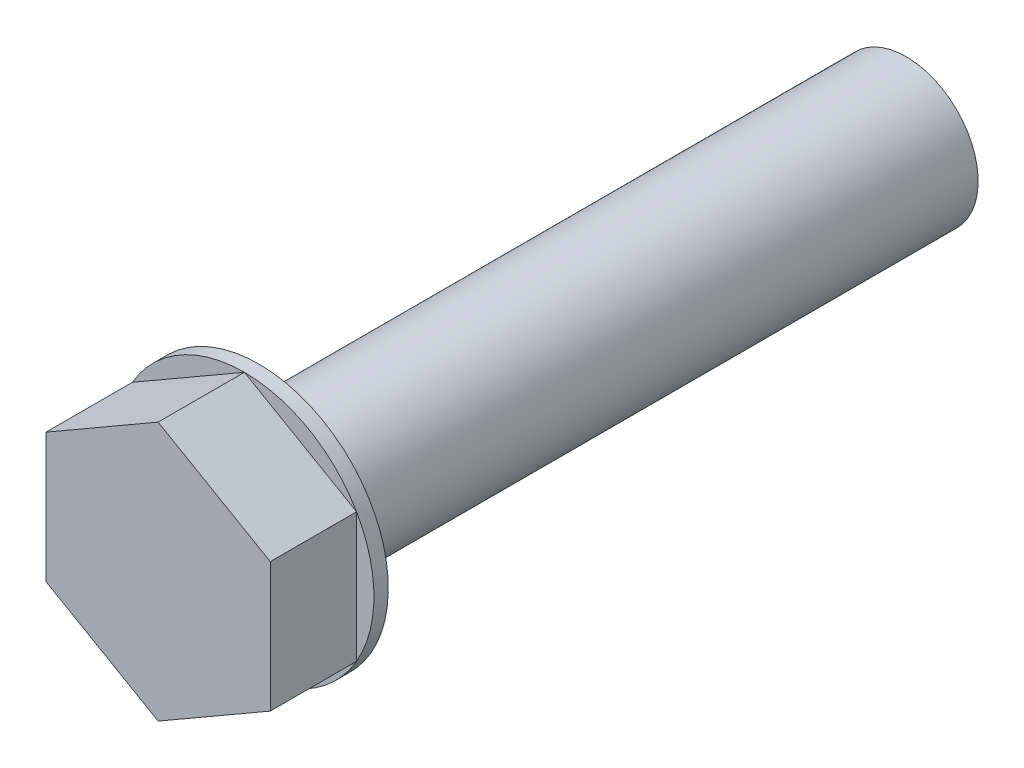
ISO-10303-21;
HEADER;
FILE_DESCRIPTION(('STEP AP214'),'2;1');
FILE_NAME('part.step','',(''),(''),'','','');
FILE_SCHEMA(('AUTOMOTIVE_DESIGN { 1 0 10303 214 1 1 1 1 }'));
ENDSEC;
DATA;
#1=APPLICATION_CONTEXT('core data for automotive mechanical design processes');
#2=APPLICATION_PROTOCOL_DEFINITION('international standard','automotive_design',2000,#1);
#3=PRODUCT_CONTEXT('',#1,'mechanical');
#4=PRODUCT('Part','Part','',(#3));
#5=PRODUCT_RELATED_PRODUCT_CATEGORY('part','',(#4));
#6=PRODUCT_DEFINITION_FORMATION('','',#4);
#7=PRODUCT_DEFINITION_CONTEXT('part definition',#1,'design');
#8=PRODUCT_DEFINITION('design','',#6,#7);
#9=PRODUCT_DEFINITION_SHAPE('','',#8);
#10=(LENGTH_UNIT() NAMED_UNIT(*) SI_UNIT(.MILLI.,.METRE.));
#11=(NAMED_UNIT(*) PLANE_ANGLE_UNIT() SI_UNIT($,.RADIAN.));
#12=(NAMED_UNIT(*) SI_UNIT($,.STERADIAN.) SOLID_ANGLE_UNIT());
#13=UNCERTAINTY_MEASURE_WITH_UNIT(LENGTH_MEASURE(1.E-05),#10,'distance_accuracy_value','');
#14=(GEOMETRIC_REPRESENTATION_CONTEXT(3) GLOBAL_UNCERTAINTY_ASSIGNED_CONTEXT((#13)) GLOBAL_UNIT_ASSIGNED_CONTEXT((#10,
#11,#12)) REPRESENTATION_CONTEXT('',''));
#15=CARTESIAN_POINT('',(0.,0.,0.));
#16=DIRECTION('',(0.,0.,1.));
#17=DIRECTION('',(1.,0.,0.));
#18=AXIS2_PLACEMENT_3D('',#15,#16,#17);
#19=CARTESIAN_POINT('',(7.7942286340599,4.50000000000009,6.));
#20=DIRECTION('',(-0.499999999999995,-0.866025403784441,0.));
#21=DIRECTION('',(0.866025403784442,-0.499999999999995,0.));
#22=AXIS2_PLACEMENT_3D('',#19,#20,#21);
#23=PLANE('',#22);
#24=DIRECTION('',(-0.866025403784442,0.499999999999995,0.));
#25=VECTOR('',#24,1.);
#26=CARTESIAN_POINT('',(7.7942286340599,4.50000000000009,0.));
#27=LINE('',#26,#25);
#28=CARTESIAN_POINT('',(7.7942286340599,4.50000000000009,0.));
#29=VERTEX_POINT('',#28);
#30=CARTESIAN_POINT('',(0.,9.,0.));
#31=VERTEX_POINT('',#30);
#32=EDGE_CURVE('E95',#29,#31,#27,.T.);
#33=ORIENTED_EDGE('',*,*,#32,.T.);
#34=DIRECTION('',(0.,0.,-1.));
#35=VECTOR('',#34,1.);
#36=CARTESIAN_POINT('',(0.,9.,6.));
#37=LINE('',#36,#35);
#38=CARTESIAN_POINT('',(0.,9.,6.));
#39=VERTEX_POINT('',#38);
#40=EDGE_CURVE('E11',#39,#31,#37,.T.);
#41=ORIENTED_EDGE('',*,*,#40,.F.);
#42=DIRECTION('',(-0.866025403784442,0.499999999999995,0.));
#43=VECTOR('',#42,1.);
#44=CARTESIAN_POINT('',(7.7942286340599,4.50000000000009,6.));
#45=LINE('',#44,#43);
#46=CARTESIAN_POINT('',(7.7942286340599,4.50000000000009,6.));
#47=VERTEX_POINT('',#46);
#48=EDGE_CURVE('E137',#47,#39,#45,.T.);
#49=ORIENTED_EDGE('',*,*,#48,.F.);
#50=DIRECTION('',(0.,0.,-1.));
#51=VECTOR('',#50,1.);
#52=CARTESIAN_POINT('',(7.7942286340599,4.50000000000009,6.));
#53=LINE('',#52,#51);
#54=EDGE_CURVE('E120',#47,#29,#53,.T.);
#55=ORIENTED_EDGE('',*,*,#54,.T.);
#56=EDGE_LOOP('',(#33,#41,#49,#55));
#57=FACE_BOUND('',#56,.T.);
#58=ADVANCED_FACE('F37',(#57),#23,.F.);
#59=CARTESIAN_POINT('',(0.,9.,6.));
#60=DIRECTION('',(0.500000000000001,-0.866025403784438,0.));
#61=DIRECTION('',(0.866025403784438,0.500000000000001,0.));
#62=AXIS2_PLACEMENT_3D('',#59,#60,#61);
#63=PLANE('',#62);
#64=DIRECTION('',(-0.866025403784438,-0.500000000000001,0.));
#65=VECTOR('',#64,1.);
#66=CARTESIAN_POINT('',(0.,9.,0.));
#67=LINE('',#66,#65);
#68=CARTESIAN_POINT('',(-7.79422863405996,4.49999999999998,0.));
#69=VERTEX_POINT('',#68);
#70=EDGE_CURVE('E85',#31,#69,#67,.T.);
#71=ORIENTED_EDGE('',*,*,#70,.T.);
#72=DIRECTION('',(0.,0.,-1.));
#73=VECTOR('',#72,1.);
#74=CARTESIAN_POINT('',(-7.79422863405996,4.49999999999998,6.));
#75=LINE('',#74,#73);
#76=CARTESIAN_POINT('',(-7.79422863405996,4.49999999999998,6.));
#77=VERTEX_POINT('',#76);
#78=EDGE_CURVE('E45',#77,#69,#75,.T.);
#79=ORIENTED_EDGE('',*,*,#78,.F.);
#80=DIRECTION('',(-0.866025403784438,-0.500000000000001,0.));
#81=VECTOR('',#80,1.);
#82=CARTESIAN_POINT('',(0.,9.,6.));
#83=LINE('',#82,#81);
#84=EDGE_CURVE('E116',#39,#77,#83,.T.);
#85=ORIENTED_EDGE('',*,*,#84,.F.);
#86=ORIENTED_EDGE('',*,*,#40,.T.);
#87=EDGE_LOOP('',(#71,#79,#85,#86));
#88=FACE_BOUND('',#87,.T.);
#89=ADVANCED_FACE('F115',(#88),#63,.F.);
#90=CARTESIAN_POINT('',(-7.79422863405996,4.49999999999998,6.));
#91=DIRECTION('',(1.,0.,0.));
#92=DIRECTION('',(0.,1.,0.));
#93=AXIS2_PLACEMENT_3D('',#90,#91,#92);
#94=PLANE('',#93);
#95=DIRECTION('',(0.,-1.,0.));
#96=VECTOR('',#95,1.);
#97=CARTESIAN_POINT('',(-7.79422863405996,4.49999999999998,0.));
#98=LINE('',#97,#96);
#99=CARTESIAN_POINT('',(-7.79422863405993,-4.50000000000004,0.));
#100=VERTEX_POINT('',#99);
#101=EDGE_CURVE('E94',#69,#100,#98,.T.);
#102=ORIENTED_EDGE('',*,*,#101,.T.);
#103=DIRECTION('',(0.,0.,-1.));
#104=VECTOR('',#103,1.);
#105=CARTESIAN_POINT('',(-7.79422863405993,-4.50000000000004,6.));
#106=LINE('',#105,#104);
#107=CARTESIAN_POINT('',(-7.79422863405993,-4.50000000000004,6.));
#108=VERTEX_POINT('',#107);
#109=EDGE_CURVE('E145',#108,#100,#106,.T.);
#110=ORIENTED_EDGE('',*,*,#109,.F.);
#111=DIRECTION('',(0.,-1.,0.));
#112=VECTOR('',#111,1.);
#113=CARTESIAN_POINT('',(-7.79422863405996,4.49999999999998,6.));
#114=LINE('',#113,#112);
#115=EDGE_CURVE('E151',#77,#108,#114,.T.);
#116=ORIENTED_EDGE('',*,*,#115,.F.);
#117=ORIENTED_EDGE('',*,*,#78,.T.);
#118=EDGE_LOOP('',(#102,#110,#116,#117));
#119=FACE_BOUND('',#118,.T.);
#120=ADVANCED_FACE('F149',(#119),#94,.F.);
#121=CARTESIAN_POINT('',(-7.79422863405993,-4.50000000000004,6.));
#122=DIRECTION('',(0.499999999999995,0.866025403784441,0.));
#123=DIRECTION('',(-0.866025403784442,0.499999999999995,0.));
#124=AXIS2_PLACEMENT_3D('',#121,#122,#123);
#125=PLANE('',#124);
#126=DIRECTION('',(0.866025403784442,-0.499999999999995,0.));
#127=VECTOR('',#126,1.);
#128=CARTESIAN_POINT('',(-7.79422863405993,-4.50000000000004,0.));
#129=LINE('',#128,#127);
#130=CARTESIAN_POINT('',(0.,-9.,0.));
#131=VERTEX_POINT('',#130);
#132=EDGE_CURVE('E129',#100,#131,#129,.T.);
#133=ORIENTED_EDGE('',*,*,#132,.T.);
#134=DIRECTION('',(0.,0.,-1.));
#135=VECTOR('',#134,1.);
#136=CARTESIAN_POINT('',(0.,-9.,6.));
#137=LINE('',#136,#135);
#138=CARTESIAN_POINT('',(0.,-9.,6.));
#139=VERTEX_POINT('',#138);
#140=EDGE_CURVE('E142',#139,#131,#137,.T.);
#141=ORIENTED_EDGE('',*,*,#140,.F.);
#142=DIRECTION('',(0.866025403784442,-0.499999999999995,0.));
#143=VECTOR('',#142,1.);
#144=CARTESIAN_POINT('',(-7.79422863405993,-4.50000000000004,6.));
#145=LINE('',#144,#143);
#146=EDGE_CURVE('E153',#108,#139,#145,.T.);
#147=ORIENTED_EDGE('',*,*,#146,.F.);
#148=ORIENTED_EDGE('',*,*,#109,.T.);
#149=EDGE_LOOP('',(#133,#141,#147,#148));
#150=FACE_BOUND('',#149,.T.);
#151=ADVANCED_FACE('F204',(#150),#125,.F.);
#152=CARTESIAN_POINT('',(0.,-9.,6.));
#153=DIRECTION('',(-0.500000000000007,0.866025403784435,0.));
#154=DIRECTION('',(-0.866025403784434,-0.500000000000007,0.));
#155=AXIS2_PLACEMENT_3D('',#152,#153,#154);
#156=PLANE('',#155);
#157=DIRECTION('',(0.866025403784434,0.500000000000007,0.));
#158=VECTOR('',#157,1.);
#159=CARTESIAN_POINT('',(0.,-9.,0.));
#160=LINE('',#159,#158);
#161=CARTESIAN_POINT('',(7.79422863405999,-4.49999999999993,0.));
#162=VERTEX_POINT('',#161);
#163=EDGE_CURVE('E132',#131,#162,#160,.T.);
#164=ORIENTED_EDGE('',*,*,#163,.T.);
#165=DIRECTION('',(0.,0.,-1.));
#166=VECTOR('',#165,1.);
#167=CARTESIAN_POINT('',(7.79422863405999,-4.49999999999993,6.));
#168=LINE('',#167,#166);
#169=CARTESIAN_POINT('',(7.79422863405999,-4.49999999999993,6.));
#170=VERTEX_POINT('',#169);
#171=EDGE_CURVE('E139',#170,#162,#168,.T.);
#172=ORIENTED_EDGE('',*,*,#171,.F.);
#173=DIRECTION('',(0.866025403784434,0.500000000000007,0.));
#174=VECTOR('',#173,1.);
#175=CARTESIAN_POINT('',(0.,-9.,6.));
#176=LINE('',#175,#174);
#177=EDGE_CURVE('E155',#139,#170,#176,.T.);
#178=ORIENTED_EDGE('',*,*,#177,.F.);
#179=ORIENTED_EDGE('',*,*,#140,.T.);
#180=EDGE_LOOP('',(#164,#172,#178,#179));
#181=FACE_BOUND('',#180,.T.);
#182=ADVANCED_FACE('F164',(#181),#156,.F.);
#183=CARTESIAN_POINT('',(7.79422863405999,-4.49999999999993,6.));
#184=DIRECTION('',(-1.,0.,0.));
#185=DIRECTION('',(0.,-1.,0.));
#186=AXIS2_PLACEMENT_3D('',#183,#184,#185);
#187=PLANE('',#186);
#188=DIRECTION('',(0.,1.,0.));
#189=VECTOR('',#188,1.);
#190=CARTESIAN_POINT('',(7.79422863405999,-4.49999999999993,0.));
#191=LINE('',#190,#189);
#192=EDGE_CURVE('E135',#162,#29,#191,.T.);
#193=ORIENTED_EDGE('',*,*,#192,.T.);
#194=ORIENTED_EDGE('',*,*,#54,.F.);
#195=DIRECTION('',(0.,1.,0.));
#196=VECTOR('',#195,1.);
#197=CARTESIAN_POINT('',(7.79422863405999,-4.49999999999993,6.));
#198=LINE('',#197,#196);
#199=EDGE_CURVE('E52',#170,#47,#198,.T.);
#200=ORIENTED_EDGE('',*,*,#199,.F.);
#201=ORIENTED_EDGE('',*,*,#171,.T.);
#202=EDGE_LOOP('',(#193,#194,#200,#201));
#203=FACE_BOUND('',#202,.T.);
#204=ADVANCED_FACE('F166',(#203),#187,.F.);
#205=CARTESIAN_POINT('',(0.,0.,6.));
#206=DIRECTION('',(0.,0.,1.));
#207=DIRECTION('',(1.,0.,0.));
#208=AXIS2_PLACEMENT_3D('',#205,#206,#207);
#209=PLANE('',#208);
#210=ORIENTED_EDGE('',*,*,#48,.T.);
#211=ORIENTED_EDGE('',*,*,#84,.T.);
#212=ORIENTED_EDGE('',*,*,#115,.T.);
#213=ORIENTED_EDGE('',*,*,#146,.T.);
#214=ORIENTED_EDGE('',*,*,#177,.T.);
#215=ORIENTED_EDGE('',*,*,#199,.T.);
#216=EDGE_LOOP('',(#210,#211,#212,#213,#214,#215));
#217=FACE_BOUND('',#216,.T.);
#218=ADVANCED_FACE('F161',(#217),#209,.T.);
#219=CARTESIAN_POINT('',(0.,0.,0.));
#220=DIRECTION('',(0.,0.,-1.));
#221=DIRECTION('',(-1.,0.,0.));
#222=AXIS2_PLACEMENT_3D('',#219,#220,#221);
#223=PLANE('',#222);
#224=ORIENTED_EDGE('',*,*,#32,.F.);
#225=CARTESIAN_POINT('',(0.,0.,0.));
#226=DIRECTION('',(0.,0.,-1.));
#227=DIRECTION('',(-1.,0.,0.));
#228=AXIS2_PLACEMENT_3D('',#225,#226,#227);
#229=CIRCLE('',#228,9.);
#230=EDGE_CURVE('E99',#31,#29,#229,.T.);
#231=ORIENTED_EDGE('',*,*,#230,.F.);
#232=EDGE_LOOP('',(#224,#231));
#233=FACE_BOUND('',#232,.T.);
#234=ADVANCED_FACE('F100',(#233),#223,.F.);
#235=ORIENTED_EDGE('',*,*,#192,.F.);
#236=EDGE_CURVE('E106',#29,#162,#229,.T.);
#237=ORIENTED_EDGE('',*,*,#236,.F.);
#238=EDGE_LOOP('',(#235,#237));
#239=FACE_BOUND('',#238,.T.);
#240=ADVANCED_FACE('F181',(#239),#223,.F.);
#241=ORIENTED_EDGE('',*,*,#163,.F.);
#242=EDGE_CURVE('E176',#162,#131,#229,.T.);
#243=ORIENTED_EDGE('',*,*,#242,.F.);
#244=EDGE_LOOP('',(#241,#243));
#245=FACE_BOUND('',#244,.T.);
#246=ADVANCED_FACE('F183',(#245),#223,.F.);
#247=ORIENTED_EDGE('',*,*,#132,.F.);
#248=EDGE_CURVE('E175',#131,#100,#229,.T.);
#249=ORIENTED_EDGE('',*,*,#248,.F.);
#250=EDGE_LOOP('',(#247,#249));
#251=FACE_BOUND('',#250,.T.);
#252=ADVANCED_FACE('F185',(#251),#223,.F.);
#253=ORIENTED_EDGE('',*,*,#101,.F.);
#254=EDGE_CURVE('E111',#100,#69,#229,.T.);
#255=ORIENTED_EDGE('',*,*,#254,.F.);
#256=EDGE_LOOP('',(#253,#255));
#257=FACE_BOUND('',#256,.T.);
#258=ADVANCED_FACE('F188',(#257),#223,.F.);
#259=ORIENTED_EDGE('',*,*,#70,.F.);
#260=EDGE_CURVE('E89',#69,#31,#229,.T.);
#261=ORIENTED_EDGE('',*,*,#260,.F.);
#262=EDGE_LOOP('',(#259,#261));
#263=FACE_BOUND('',#262,.T.);
#264=ADVANCED_FACE('F87',(#263),#223,.F.);
#265=CARTESIAN_POINT('',(0.,0.,-1.));
#266=DIRECTION('',(0.,0.,1.));
#267=DIRECTION('',(1.,0.,0.));
#268=AXIS2_PLACEMENT_3D('',#265,#266,#267);
#269=CYLINDRICAL_SURFACE('',#268,9.);
#270=CARTESIAN_POINT('',(0.,0.,-1.));
#271=DIRECTION('',(0.,0.,-1.));
#272=DIRECTION('',(-1.,0.,0.));
#273=AXIS2_PLACEMENT_3D('',#270,#271,#272);
#274=CIRCLE('',#273,9.);
#275=CARTESIAN_POINT('',(-9.,0.,-1.));
#276=VERTEX_POINT('',#275);
#277=EDGE_CURVE('E113',#276,#276,#274,.T.);
#278=ORIENTED_EDGE('',*,*,#277,.F.);
#279=EDGE_LOOP('',(#278));
#280=FACE_BOUND('',#279,.T.);
#281=ORIENTED_EDGE('',*,*,#260,.T.);
#282=ORIENTED_EDGE('',*,*,#230,.T.);
#283=ORIENTED_EDGE('',*,*,#236,.T.);
#284=ORIENTED_EDGE('',*,*,#242,.T.);
#285=ORIENTED_EDGE('',*,*,#248,.T.);
#286=ORIENTED_EDGE('',*,*,#254,.T.);
#287=EDGE_LOOP('',(#281,#282,#283,#284,#285,#286));
#288=FACE_BOUND('',#287,.T.);
#289=ADVANCED_FACE('F108',(#280,#288),#269,.T.);
#290=CARTESIAN_POINT('',(0.,0.,-1.));
#291=DIRECTION('',(0.,0.,-1.));
#292=DIRECTION('',(-1.,0.,0.));
#293=AXIS2_PLACEMENT_3D('',#290,#291,#292);
#294=PLANE('',#293);
#295=CARTESIAN_POINT('',(0.,0.,-1.));
#296=DIRECTION('',(0.,0.,-1.));
#297=DIRECTION('',(-1.,0.,0.));
#298=AXIS2_PLACEMENT_3D('',#295,#296,#297);
#299=CIRCLE('',#298,5.);
#300=CARTESIAN_POINT('',(-5.,0.,-1.));
#301=VERTEX_POINT('',#300);
#302=EDGE_CURVE('E168',#301,#301,#299,.T.);
#303=ORIENTED_EDGE('',*,*,#302,.F.);
#304=EDGE_LOOP('',(#303));
#305=FACE_BOUND('',#304,.T.);
#306=ORIENTED_EDGE('',*,*,#277,.T.);
#307=EDGE_LOOP('',(#306));
#308=FACE_BOUND('',#307,.T.);
#309=ADVANCED_FACE('F215',(#305,#308),#294,.T.);
#310=CARTESIAN_POINT('',(0.,0.,-46.));
#311=DIRECTION('',(0.,0.,1.));
#312=DIRECTION('',(1.,0.,0.));
#313=AXIS2_PLACEMENT_3D('',#310,#311,#312);
#314=CYLINDRICAL_SURFACE('',#313,5.);
#315=CARTESIAN_POINT('',(0.,0.,-46.));
#316=DIRECTION('',(0.,0.,-1.));
#317=DIRECTION('',(-1.,0.,0.));
#318=AXIS2_PLACEMENT_3D('',#315,#316,#317);
#319=CIRCLE('',#318,5.);
#320=CARTESIAN_POINT('',(-5.,0.,-46.));
#321=VERTEX_POINT('',#320);
#322=EDGE_CURVE('E171',#321,#321,#319,.T.);
#323=ORIENTED_EDGE('',*,*,#322,.F.);
#324=EDGE_LOOP('',(#323));
#325=FACE_BOUND('',#324,.T.);
#326=ORIENTED_EDGE('',*,*,#302,.T.);
#327=EDGE_LOOP('',(#326));
#328=FACE_BOUND('',#327,.T.);
#329=ADVANCED_FACE('F220',(#325,#328),#314,.T.);
#330=CARTESIAN_POINT('',(0.,0.,-46.));
#331=DIRECTION('',(0.,0.,-1.));
#332=DIRECTION('',(-1.,0.,0.));
#333=AXIS2_PLACEMENT_3D('',#330,#331,#332);
#334=PLANE('',#333);
#335=ORIENTED_EDGE('',*,*,#322,.T.);
#336=EDGE_LOOP('',(#335));
#337=FACE_BOUND('',#336,.T.);
#338=ADVANCED_FACE('F227',(#337),#334,.T.);
#339=CLOSED_SHELL('',(#58,#89,#120,#151,#182,#204,#218,#234,#240,#246,#252,#258,#264,#289,#309,
#329,#338));
#340=MANIFOLD_SOLID_BREP('B2',#339);
#341=ADVANCED_BREP_SHAPE_REPRESENTATION('',(#18,#340),#14);
#342=SHAPE_DEFINITION_REPRESENTATION(#9,#341);
ENDSEC;
END-ISO-10303-21;
